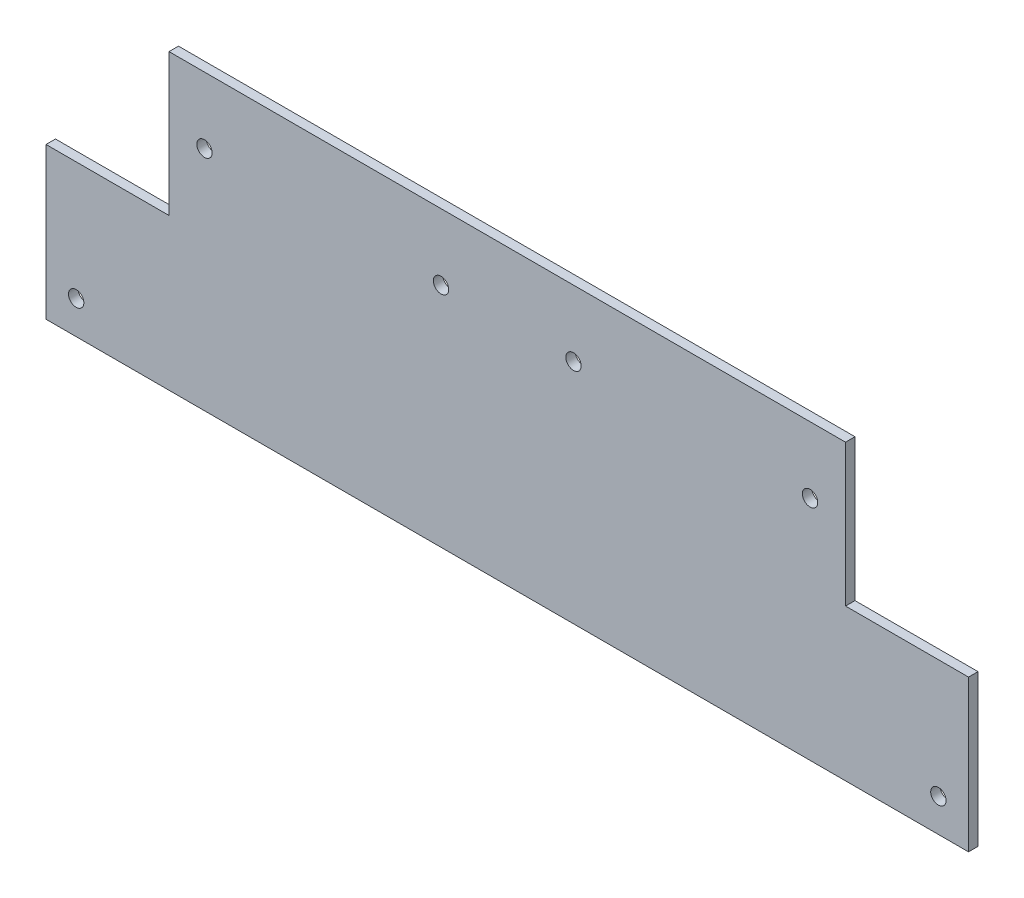
ISO-10303-21;
HEADER;
FILE_DESCRIPTION(('STEP AP214'),'2;1');
FILE_NAME('part.step','',(''),(''),'','','');
FILE_SCHEMA(('AUTOMOTIVE_DESIGN { 1 0 10303 214 1 1 1 1 }'));
ENDSEC;
DATA;
#1=APPLICATION_CONTEXT('core data for automotive mechanical design processes');
#2=APPLICATION_PROTOCOL_DEFINITION('international standard','automotive_design',2000,#1);
#3=PRODUCT_CONTEXT('',#1,'mechanical');
#4=PRODUCT('Part','Part','',(#3));
#5=PRODUCT_RELATED_PRODUCT_CATEGORY('part','',(#4));
#6=PRODUCT_DEFINITION_FORMATION('','',#4);
#7=PRODUCT_DEFINITION_CONTEXT('part definition',#1,'design');
#8=PRODUCT_DEFINITION('design','',#6,#7);
#9=PRODUCT_DEFINITION_SHAPE('','',#8);
#10=(LENGTH_UNIT() NAMED_UNIT(*) SI_UNIT(.MILLI.,.METRE.));
#11=(NAMED_UNIT(*) PLANE_ANGLE_UNIT() SI_UNIT($,.RADIAN.));
#12=(NAMED_UNIT(*) SI_UNIT($,.STERADIAN.) SOLID_ANGLE_UNIT());
#13=UNCERTAINTY_MEASURE_WITH_UNIT(LENGTH_MEASURE(1.E-05),#10,'distance_accuracy_value','');
#14=(GEOMETRIC_REPRESENTATION_CONTEXT(3) GLOBAL_UNCERTAINTY_ASSIGNED_CONTEXT((#13)) GLOBAL_UNIT_ASSIGNED_CONTEXT((#10,
#11,#12)) REPRESENTATION_CONTEXT('',''));
#15=CARTESIAN_POINT('',(0.,0.,0.));
#16=DIRECTION('',(0.,0.,1.));
#17=DIRECTION('',(1.,0.,0.));
#18=AXIS2_PLACEMENT_3D('',#15,#16,#17);
#19=CARTESIAN_POINT('',(0.,0.,2.));
#20=DIRECTION('',(0.,0.,1.));
#21=DIRECTION('',(1.,0.,0.));
#22=AXIS2_PLACEMENT_3D('',#19,#20,#21);
#23=PLANE('',#22);
#24=CARTESIAN_POINT('',(-64.,48.,2.));
#25=DIRECTION('',(0.,0.,1.));
#26=DIRECTION('',(-1.,0.,0.));
#27=AXIS2_PLACEMENT_3D('',#24,#25,#26);
#28=CIRCLE('',#27,1.625);
#29=CARTESIAN_POINT('',(-65.625,48.,2.));
#30=VERTEX_POINT('',#29);
#31=EDGE_CURVE('E203',#30,#30,#28,.T.);
#32=ORIENTED_EDGE('',*,*,#31,.F.);
#33=EDGE_LOOP('',(#32));
#34=FACE_BOUND('',#33,.T.);
#35=CARTESIAN_POINT('',(14.,48.,2.));
#36=DIRECTION('',(0.,0.,1.));
#37=DIRECTION('',(1.,0.,0.));
#38=AXIS2_PLACEMENT_3D('',#35,#36,#37);
#39=CIRCLE('',#38,1.625);
#40=CARTESIAN_POINT('',(15.625,48.,2.));
#41=VERTEX_POINT('',#40);
#42=EDGE_CURVE('E191',#41,#41,#39,.T.);
#43=ORIENTED_EDGE('',*,*,#42,.F.);
#44=EDGE_LOOP('',(#43));
#45=FACE_BOUND('',#44,.T.);
#46=CARTESIAN_POINT('',(91.125,7.,2.));
#47=DIRECTION('',(0.,0.,1.));
#48=DIRECTION('',(1.,0.,0.));
#49=AXIS2_PLACEMENT_3D('',#46,#47,#48);
#50=CIRCLE('',#49,1.625);
#51=CARTESIAN_POINT('',(92.75,7.,2.));
#52=VERTEX_POINT('',#51);
#53=EDGE_CURVE('E137',#52,#52,#50,.T.);
#54=ORIENTED_EDGE('',*,*,#53,.F.);
#55=EDGE_LOOP('',(#54));
#56=FACE_BOUND('',#55,.T.);
#57=DIRECTION('',(0.,1.,0.));
#58=VECTOR('',#57,1.);
#59=CARTESIAN_POINT('',(97.5,0.,2.));
#60=LINE('',#59,#58);
#61=CARTESIAN_POINT('',(97.5,0.,2.));
#62=VERTEX_POINT('',#61);
#63=CARTESIAN_POINT('',(97.5,32.,2.));
#64=VERTEX_POINT('',#63);
#65=EDGE_CURVE('E148',#62,#64,#60,.T.);
#66=ORIENTED_EDGE('',*,*,#65,.T.);
#67=DIRECTION('',(-1.,0.,0.));
#68=VECTOR('',#67,1.);
#69=CARTESIAN_POINT('',(97.5,32.,2.));
#70=LINE('',#69,#68);
#71=CARTESIAN_POINT('',(71.5,32.,2.));
#72=VERTEX_POINT('',#71);
#73=EDGE_CURVE('E96',#64,#72,#70,.T.);
#74=ORIENTED_EDGE('',*,*,#73,.T.);
#75=DIRECTION('',(0.,1.,0.));
#76=VECTOR('',#75,1.);
#77=CARTESIAN_POINT('',(71.5,32.,2.));
#78=LINE('',#77,#76);
#79=CARTESIAN_POINT('',(71.5,62.,2.));
#80=VERTEX_POINT('',#79);
#81=EDGE_CURVE('E163',#72,#80,#78,.T.);
#82=ORIENTED_EDGE('',*,*,#81,.T.);
#83=DIRECTION('',(-1.,0.,0.));
#84=VECTOR('',#83,1.);
#85=CARTESIAN_POINT('',(71.5,62.,2.));
#86=LINE('',#85,#84);
#87=CARTESIAN_POINT('',(-71.5,62.,2.));
#88=VERTEX_POINT('',#87);
#89=EDGE_CURVE('E176',#80,#88,#86,.T.);
#90=ORIENTED_EDGE('',*,*,#89,.T.);
#91=DIRECTION('',(0.,-1.,0.));
#92=VECTOR('',#91,1.);
#93=CARTESIAN_POINT('',(-71.5,32.,2.));
#94=LINE('',#93,#92);
#95=CARTESIAN_POINT('',(-71.5,32.,2.));
#96=VERTEX_POINT('',#95);
#97=EDGE_CURVE('E115',#88,#96,#94,.T.);
#98=ORIENTED_EDGE('',*,*,#97,.T.);
#99=DIRECTION('',(-1.,0.,0.));
#100=VECTOR('',#99,1.);
#101=CARTESIAN_POINT('',(-97.5,32.,2.));
#102=LINE('',#101,#100);
#103=CARTESIAN_POINT('',(-97.5,32.,2.));
#104=VERTEX_POINT('',#103);
#105=EDGE_CURVE('E109',#96,#104,#102,.T.);
#106=ORIENTED_EDGE('',*,*,#105,.T.);
#107=DIRECTION('',(0.,-1.,0.));
#108=VECTOR('',#107,1.);
#109=CARTESIAN_POINT('',(-97.5,0.,2.));
#110=LINE('',#109,#108);
#111=CARTESIAN_POINT('',(-97.5,0.,2.));
#112=VERTEX_POINT('',#111);
#113=EDGE_CURVE('E113',#104,#112,#110,.T.);
#114=ORIENTED_EDGE('',*,*,#113,.T.);
#115=DIRECTION('',(1.,0.,0.));
#116=VECTOR('',#115,1.);
#117=CARTESIAN_POINT('',(-97.5,0.,2.));
#118=LINE('',#117,#116);
#119=EDGE_CURVE('E53',#112,#62,#118,.T.);
#120=ORIENTED_EDGE('',*,*,#119,.T.);
#121=EDGE_LOOP('',(#66,#74,#82,#90,#98,#106,#114,#120));
#122=FACE_BOUND('',#121,.T.);
#123=CARTESIAN_POINT('',(64.,48.,2.));
#124=DIRECTION('',(0.,0.,1.));
#125=DIRECTION('',(1.,0.,0.));
#126=AXIS2_PLACEMENT_3D('',#123,#124,#125);
#127=CIRCLE('',#126,1.625);
#128=CARTESIAN_POINT('',(65.625,48.,2.));
#129=VERTEX_POINT('',#128);
#130=EDGE_CURVE('E185',#129,#129,#127,.T.);
#131=ORIENTED_EDGE('',*,*,#130,.F.);
#132=EDGE_LOOP('',(#131));
#133=FACE_BOUND('',#132,.T.);
#134=CARTESIAN_POINT('',(-14.,48.,2.));
#135=DIRECTION('',(0.,0.,1.));
#136=DIRECTION('',(-1.,0.,0.));
#137=AXIS2_PLACEMENT_3D('',#134,#135,#136);
#138=CIRCLE('',#137,1.625);
#139=CARTESIAN_POINT('',(-15.625,48.,2.));
#140=VERTEX_POINT('',#139);
#141=EDGE_CURVE('E197',#140,#140,#138,.T.);
#142=ORIENTED_EDGE('',*,*,#141,.F.);
#143=EDGE_LOOP('',(#142));
#144=FACE_BOUND('',#143,.T.);
#145=CARTESIAN_POINT('',(-91.125,7.,2.));
#146=DIRECTION('',(0.,0.,1.));
#147=DIRECTION('',(-1.,0.,0.));
#148=AXIS2_PLACEMENT_3D('',#145,#146,#147);
#149=CIRCLE('',#148,1.625);
#150=CARTESIAN_POINT('',(-92.75,7.,2.));
#151=VERTEX_POINT('',#150);
#152=EDGE_CURVE('E209',#151,#151,#149,.T.);
#153=ORIENTED_EDGE('',*,*,#152,.F.);
#154=EDGE_LOOP('',(#153));
#155=FACE_BOUND('',#154,.T.);
#156=ADVANCED_FACE('F36',(#34,#45,#56,#122,#133,#144,#155),#23,.T.);
#157=CARTESIAN_POINT('',(0.,0.,0.));
#158=DIRECTION('',(0.,0.,1.));
#159=DIRECTION('',(1.,0.,0.));
#160=AXIS2_PLACEMENT_3D('',#157,#158,#159);
#161=PLANE('',#160);
#162=DIRECTION('',(0.,1.,0.));
#163=VECTOR('',#162,1.);
#164=CARTESIAN_POINT('',(97.5,0.,0.));
#165=LINE('',#164,#163);
#166=CARTESIAN_POINT('',(97.5,0.,0.));
#167=VERTEX_POINT('',#166);
#168=CARTESIAN_POINT('',(97.5,32.,0.));
#169=VERTEX_POINT('',#168);
#170=EDGE_CURVE('E133',#167,#169,#165,.T.);
#171=ORIENTED_EDGE('',*,*,#170,.F.);
#172=DIRECTION('',(1.,0.,0.));
#173=VECTOR('',#172,1.);
#174=CARTESIAN_POINT('',(-97.5,0.,0.));
#175=LINE('',#174,#173);
#176=CARTESIAN_POINT('',(-97.5,0.,0.));
#177=VERTEX_POINT('',#176);
#178=EDGE_CURVE('E88',#177,#167,#175,.T.);
#179=ORIENTED_EDGE('',*,*,#178,.F.);
#180=DIRECTION('',(0.,-1.,0.));
#181=VECTOR('',#180,1.);
#182=CARTESIAN_POINT('',(-97.5,0.,0.));
#183=LINE('',#182,#181);
#184=CARTESIAN_POINT('',(-97.5,32.,0.));
#185=VERTEX_POINT('',#184);
#186=EDGE_CURVE('E82',#185,#177,#183,.T.);
#187=ORIENTED_EDGE('',*,*,#186,.F.);
#188=DIRECTION('',(-1.,0.,0.));
#189=VECTOR('',#188,1.);
#190=CARTESIAN_POINT('',(-97.5,32.,0.));
#191=LINE('',#190,#189);
#192=CARTESIAN_POINT('',(-71.5,32.,0.));
#193=VERTEX_POINT('',#192);
#194=EDGE_CURVE('E123',#193,#185,#191,.T.);
#195=ORIENTED_EDGE('',*,*,#194,.F.);
#196=DIRECTION('',(0.,-1.,0.));
#197=VECTOR('',#196,1.);
#198=CARTESIAN_POINT('',(-71.5,32.,0.));
#199=LINE('',#198,#197);
#200=CARTESIAN_POINT('',(-71.5,62.,0.));
#201=VERTEX_POINT('',#200);
#202=EDGE_CURVE('E143',#201,#193,#199,.T.);
#203=ORIENTED_EDGE('',*,*,#202,.F.);
#204=DIRECTION('',(-1.,0.,0.));
#205=VECTOR('',#204,1.);
#206=CARTESIAN_POINT('',(71.5,62.,0.));
#207=LINE('',#206,#205);
#208=CARTESIAN_POINT('',(71.5,62.,0.));
#209=VERTEX_POINT('',#208);
#210=EDGE_CURVE('E141',#209,#201,#207,.T.);
#211=ORIENTED_EDGE('',*,*,#210,.F.);
#212=DIRECTION('',(0.,1.,0.));
#213=VECTOR('',#212,1.);
#214=CARTESIAN_POINT('',(71.5,32.,0.));
#215=LINE('',#214,#213);
#216=CARTESIAN_POINT('',(71.5,32.,0.));
#217=VERTEX_POINT('',#216);
#218=EDGE_CURVE('E139',#217,#209,#215,.T.);
#219=ORIENTED_EDGE('',*,*,#218,.F.);
#220=DIRECTION('',(-1.,0.,0.));
#221=VECTOR('',#220,1.);
#222=CARTESIAN_POINT('',(97.5,32.,0.));
#223=LINE('',#222,#221);
#224=EDGE_CURVE('E136',#169,#217,#223,.T.);
#225=ORIENTED_EDGE('',*,*,#224,.F.);
#226=EDGE_LOOP('',(#171,#179,#187,#195,#203,#211,#219,#225));
#227=FACE_BOUND('',#226,.T.);
#228=CARTESIAN_POINT('',(91.125,7.,0.));
#229=DIRECTION('',(0.,0.,1.));
#230=DIRECTION('',(1.,0.,0.));
#231=AXIS2_PLACEMENT_3D('',#228,#229,#230);
#232=CIRCLE('',#231,1.625);
#233=CARTESIAN_POINT('',(92.75,7.,0.));
#234=VERTEX_POINT('',#233);
#235=EDGE_CURVE('E182',#234,#234,#232,.T.);
#236=ORIENTED_EDGE('',*,*,#235,.T.);
#237=EDGE_LOOP('',(#236));
#238=FACE_BOUND('',#237,.T.);
#239=CARTESIAN_POINT('',(64.,48.,0.));
#240=DIRECTION('',(0.,0.,1.));
#241=DIRECTION('',(1.,0.,0.));
#242=AXIS2_PLACEMENT_3D('',#239,#240,#241);
#243=CIRCLE('',#242,1.625);
#244=CARTESIAN_POINT('',(65.625,48.,0.));
#245=VERTEX_POINT('',#244);
#246=EDGE_CURVE('E188',#245,#245,#243,.T.);
#247=ORIENTED_EDGE('',*,*,#246,.T.);
#248=EDGE_LOOP('',(#247));
#249=FACE_BOUND('',#248,.T.);
#250=CARTESIAN_POINT('',(14.,48.,0.));
#251=DIRECTION('',(0.,0.,1.));
#252=DIRECTION('',(1.,0.,0.));
#253=AXIS2_PLACEMENT_3D('',#250,#251,#252);
#254=CIRCLE('',#253,1.625);
#255=CARTESIAN_POINT('',(15.625,48.,0.));
#256=VERTEX_POINT('',#255);
#257=EDGE_CURVE('E194',#256,#256,#254,.T.);
#258=ORIENTED_EDGE('',*,*,#257,.T.);
#259=EDGE_LOOP('',(#258));
#260=FACE_BOUND('',#259,.T.);
#261=CARTESIAN_POINT('',(-14.,48.,0.));
#262=DIRECTION('',(0.,0.,1.));
#263=DIRECTION('',(-1.,0.,0.));
#264=AXIS2_PLACEMENT_3D('',#261,#262,#263);
#265=CIRCLE('',#264,1.625);
#266=CARTESIAN_POINT('',(-15.625,48.,0.));
#267=VERTEX_POINT('',#266);
#268=EDGE_CURVE('E200',#267,#267,#265,.T.);
#269=ORIENTED_EDGE('',*,*,#268,.T.);
#270=EDGE_LOOP('',(#269));
#271=FACE_BOUND('',#270,.T.);
#272=CARTESIAN_POINT('',(-64.,48.,0.));
#273=DIRECTION('',(0.,0.,1.));
#274=DIRECTION('',(-1.,0.,0.));
#275=AXIS2_PLACEMENT_3D('',#272,#273,#274);
#276=CIRCLE('',#275,1.625);
#277=CARTESIAN_POINT('',(-65.625,48.,0.));
#278=VERTEX_POINT('',#277);
#279=EDGE_CURVE('E206',#278,#278,#276,.T.);
#280=ORIENTED_EDGE('',*,*,#279,.T.);
#281=EDGE_LOOP('',(#280));
#282=FACE_BOUND('',#281,.T.);
#283=CARTESIAN_POINT('',(-91.125,7.,0.));
#284=DIRECTION('',(0.,0.,1.));
#285=DIRECTION('',(-1.,0.,0.));
#286=AXIS2_PLACEMENT_3D('',#283,#284,#285);
#287=CIRCLE('',#286,1.625);
#288=CARTESIAN_POINT('',(-92.75,7.,0.));
#289=VERTEX_POINT('',#288);
#290=EDGE_CURVE('E212',#289,#289,#287,.T.);
#291=ORIENTED_EDGE('',*,*,#290,.T.);
#292=EDGE_LOOP('',(#291));
#293=FACE_BOUND('',#292,.T.);
#294=ADVANCED_FACE('F167',(#227,#238,#249,#260,#271,#282,#293),#161,.F.);
#295=CARTESIAN_POINT('',(97.5,0.,2.));
#296=DIRECTION('',(-1.,0.,0.));
#297=DIRECTION('',(0.,0.,1.));
#298=AXIS2_PLACEMENT_3D('',#295,#296,#297);
#299=PLANE('',#298);
#300=ORIENTED_EDGE('',*,*,#170,.T.);
#301=DIRECTION('',(0.,0.,-1.));
#302=VECTOR('',#301,1.);
#303=CARTESIAN_POINT('',(97.5,32.,2.));
#304=LINE('',#303,#302);
#305=EDGE_CURVE('E11',#64,#169,#304,.T.);
#306=ORIENTED_EDGE('',*,*,#305,.F.);
#307=ORIENTED_EDGE('',*,*,#65,.F.);
#308=DIRECTION('',(0.,0.,-1.));
#309=VECTOR('',#308,1.);
#310=CARTESIAN_POINT('',(97.5,0.,2.));
#311=LINE('',#310,#309);
#312=EDGE_CURVE('E129',#62,#167,#311,.T.);
#313=ORIENTED_EDGE('',*,*,#312,.T.);
#314=EDGE_LOOP('',(#300,#306,#307,#313));
#315=FACE_BOUND('',#314,.T.);
#316=ADVANCED_FACE('F38',(#315),#299,.F.);
#317=CARTESIAN_POINT('',(97.5,32.,2.));
#318=DIRECTION('',(0.,-1.,0.));
#319=DIRECTION('',(0.,0.,-1.));
#320=AXIS2_PLACEMENT_3D('',#317,#318,#319);
#321=PLANE('',#320);
#322=ORIENTED_EDGE('',*,*,#224,.T.);
#323=DIRECTION('',(0.,0.,-1.));
#324=VECTOR('',#323,1.);
#325=CARTESIAN_POINT('',(71.5,32.,2.));
#326=LINE('',#325,#324);
#327=EDGE_CURVE('E45',#72,#217,#326,.T.);
#328=ORIENTED_EDGE('',*,*,#327,.F.);
#329=ORIENTED_EDGE('',*,*,#73,.F.);
#330=ORIENTED_EDGE('',*,*,#305,.T.);
#331=EDGE_LOOP('',(#322,#328,#329,#330));
#332=FACE_BOUND('',#331,.T.);
#333=ADVANCED_FACE('F246',(#332),#321,.F.);
#334=CARTESIAN_POINT('',(71.5,32.,2.));
#335=DIRECTION('',(-1.,0.,0.));
#336=DIRECTION('',(0.,0.,1.));
#337=AXIS2_PLACEMENT_3D('',#334,#335,#336);
#338=PLANE('',#337);
#339=ORIENTED_EDGE('',*,*,#218,.T.);
#340=DIRECTION('',(0.,0.,-1.));
#341=VECTOR('',#340,1.);
#342=CARTESIAN_POINT('',(71.5,62.,2.));
#343=LINE('',#342,#341);
#344=EDGE_CURVE('E155',#80,#209,#343,.T.);
#345=ORIENTED_EDGE('',*,*,#344,.F.);
#346=ORIENTED_EDGE('',*,*,#81,.F.);
#347=ORIENTED_EDGE('',*,*,#327,.T.);
#348=EDGE_LOOP('',(#339,#345,#346,#347));
#349=FACE_BOUND('',#348,.T.);
#350=ADVANCED_FACE('F161',(#349),#338,.F.);
#351=CARTESIAN_POINT('',(71.5,62.,2.));
#352=DIRECTION('',(0.,-1.,0.));
#353=DIRECTION('',(0.,0.,-1.));
#354=AXIS2_PLACEMENT_3D('',#351,#352,#353);
#355=PLANE('',#354);
#356=ORIENTED_EDGE('',*,*,#210,.T.);
#357=DIRECTION('',(0.,0.,-1.));
#358=VECTOR('',#357,1.);
#359=CARTESIAN_POINT('',(-71.5,62.,2.));
#360=LINE('',#359,#358);
#361=EDGE_CURVE('E152',#88,#201,#360,.T.);
#362=ORIENTED_EDGE('',*,*,#361,.F.);
#363=ORIENTED_EDGE('',*,*,#89,.F.);
#364=ORIENTED_EDGE('',*,*,#344,.T.);
#365=EDGE_LOOP('',(#356,#362,#363,#364));
#366=FACE_BOUND('',#365,.T.);
#367=ADVANCED_FACE('F172',(#366),#355,.F.);
#368=CARTESIAN_POINT('',(-71.5,32.,2.));
#369=DIRECTION('',(1.,0.,0.));
#370=DIRECTION('',(0.,0.,-1.));
#371=AXIS2_PLACEMENT_3D('',#368,#369,#370);
#372=PLANE('',#371);
#373=ORIENTED_EDGE('',*,*,#202,.T.);
#374=DIRECTION('',(0.,0.,-1.));
#375=VECTOR('',#374,1.);
#376=CARTESIAN_POINT('',(-71.5,32.,2.));
#377=LINE('',#376,#375);
#378=EDGE_CURVE('E124',#96,#193,#377,.T.);
#379=ORIENTED_EDGE('',*,*,#378,.F.);
#380=ORIENTED_EDGE('',*,*,#97,.F.);
#381=ORIENTED_EDGE('',*,*,#361,.T.);
#382=EDGE_LOOP('',(#373,#379,#380,#381));
#383=FACE_BOUND('',#382,.T.);
#384=ADVANCED_FACE('F175',(#383),#372,.F.);
#385=CARTESIAN_POINT('',(-97.5,32.,2.));
#386=DIRECTION('',(0.,-1.,0.));
#387=DIRECTION('',(0.,0.,-1.));
#388=AXIS2_PLACEMENT_3D('',#385,#386,#387);
#389=PLANE('',#388);
#390=ORIENTED_EDGE('',*,*,#194,.T.);
#391=DIRECTION('',(0.,0.,-1.));
#392=VECTOR('',#391,1.);
#393=CARTESIAN_POINT('',(-97.5,32.,2.));
#394=LINE('',#393,#392);
#395=EDGE_CURVE('E120',#104,#185,#394,.T.);
#396=ORIENTED_EDGE('',*,*,#395,.F.);
#397=ORIENTED_EDGE('',*,*,#105,.F.);
#398=ORIENTED_EDGE('',*,*,#378,.T.);
#399=EDGE_LOOP('',(#390,#396,#397,#398));
#400=FACE_BOUND('',#399,.T.);
#401=ADVANCED_FACE('F121',(#400),#389,.F.);
#402=CARTESIAN_POINT('',(-97.5,0.,2.));
#403=DIRECTION('',(1.,0.,0.));
#404=DIRECTION('',(0.,0.,-1.));
#405=AXIS2_PLACEMENT_3D('',#402,#403,#404);
#406=PLANE('',#405);
#407=ORIENTED_EDGE('',*,*,#186,.T.);
#408=DIRECTION('',(0.,0.,-1.));
#409=VECTOR('',#408,1.);
#410=CARTESIAN_POINT('',(-97.5,0.,2.));
#411=LINE('',#410,#409);
#412=EDGE_CURVE('E125',#112,#177,#411,.T.);
#413=ORIENTED_EDGE('',*,*,#412,.F.);
#414=ORIENTED_EDGE('',*,*,#113,.F.);
#415=ORIENTED_EDGE('',*,*,#395,.T.);
#416=EDGE_LOOP('',(#407,#413,#414,#415));
#417=FACE_BOUND('',#416,.T.);
#418=ADVANCED_FACE('F127',(#417),#406,.F.);
#419=CARTESIAN_POINT('',(-97.5,0.,2.));
#420=DIRECTION('',(0.,1.,0.));
#421=DIRECTION('',(0.,0.,1.));
#422=AXIS2_PLACEMENT_3D('',#419,#420,#421);
#423=PLANE('',#422);
#424=ORIENTED_EDGE('',*,*,#178,.T.);
#425=ORIENTED_EDGE('',*,*,#312,.F.);
#426=ORIENTED_EDGE('',*,*,#119,.F.);
#427=ORIENTED_EDGE('',*,*,#412,.T.);
#428=EDGE_LOOP('',(#424,#425,#426,#427));
#429=FACE_BOUND('',#428,.T.);
#430=ADVANCED_FACE('F234',(#429),#423,.F.);
#431=CARTESIAN_POINT('',(91.125,7.,2.));
#432=DIRECTION('',(0.,0.,-1.));
#433=DIRECTION('',(-1.,0.,0.));
#434=AXIS2_PLACEMENT_3D('',#431,#432,#433);
#435=CYLINDRICAL_SURFACE('',#434,1.625);
#436=ORIENTED_EDGE('',*,*,#53,.T.);
#437=EDGE_LOOP('',(#436));
#438=FACE_BOUND('',#437,.T.);
#439=ORIENTED_EDGE('',*,*,#235,.F.);
#440=EDGE_LOOP('',(#439));
#441=FACE_BOUND('',#440,.T.);
#442=ADVANCED_FACE('F231',(#438,#441),#435,.F.);
#443=CARTESIAN_POINT('',(64.,48.,2.));
#444=DIRECTION('',(0.,0.,-1.));
#445=DIRECTION('',(-1.,0.,0.));
#446=AXIS2_PLACEMENT_3D('',#443,#444,#445);
#447=CYLINDRICAL_SURFACE('',#446,1.625);
#448=ORIENTED_EDGE('',*,*,#130,.T.);
#449=EDGE_LOOP('',(#448));
#450=FACE_BOUND('',#449,.T.);
#451=ORIENTED_EDGE('',*,*,#246,.F.);
#452=EDGE_LOOP('',(#451));
#453=FACE_BOUND('',#452,.T.);
#454=ADVANCED_FACE('F310',(#450,#453),#447,.F.);
#455=CARTESIAN_POINT('',(14.,48.,2.));
#456=DIRECTION('',(0.,0.,-1.));
#457=DIRECTION('',(-1.,0.,0.));
#458=AXIS2_PLACEMENT_3D('',#455,#456,#457);
#459=CYLINDRICAL_SURFACE('',#458,1.625);
#460=ORIENTED_EDGE('',*,*,#42,.T.);
#461=EDGE_LOOP('',(#460));
#462=FACE_BOUND('',#461,.T.);
#463=ORIENTED_EDGE('',*,*,#257,.F.);
#464=EDGE_LOOP('',(#463));
#465=FACE_BOUND('',#464,.T.);
#466=ADVANCED_FACE('F318',(#462,#465),#459,.F.);
#467=CARTESIAN_POINT('',(-14.,48.,2.));
#468=DIRECTION('',(0.,0.,-1.));
#469=DIRECTION('',(-1.,0.,0.));
#470=AXIS2_PLACEMENT_3D('',#467,#468,#469);
#471=CYLINDRICAL_SURFACE('',#470,1.625);
#472=ORIENTED_EDGE('',*,*,#141,.T.);
#473=EDGE_LOOP('',(#472));
#474=FACE_BOUND('',#473,.T.);
#475=ORIENTED_EDGE('',*,*,#268,.F.);
#476=EDGE_LOOP('',(#475));
#477=FACE_BOUND('',#476,.T.);
#478=ADVANCED_FACE('F326',(#474,#477),#471,.F.);
#479=CARTESIAN_POINT('',(-64.,48.,2.));
#480=DIRECTION('',(0.,0.,-1.));
#481=DIRECTION('',(-1.,0.,0.));
#482=AXIS2_PLACEMENT_3D('',#479,#480,#481);
#483=CYLINDRICAL_SURFACE('',#482,1.625);
#484=ORIENTED_EDGE('',*,*,#31,.T.);
#485=EDGE_LOOP('',(#484));
#486=FACE_BOUND('',#485,.T.);
#487=ORIENTED_EDGE('',*,*,#279,.F.);
#488=EDGE_LOOP('',(#487));
#489=FACE_BOUND('',#488,.T.);
#490=ADVANCED_FACE('F335',(#486,#489),#483,.F.);
#491=CARTESIAN_POINT('',(-91.125,7.,2.));
#492=DIRECTION('',(0.,0.,-1.));
#493=DIRECTION('',(-1.,0.,0.));
#494=AXIS2_PLACEMENT_3D('',#491,#492,#493);
#495=CYLINDRICAL_SURFACE('',#494,1.625);
#496=ORIENTED_EDGE('',*,*,#152,.T.);
#497=EDGE_LOOP('',(#496));
#498=FACE_BOUND('',#497,.T.);
#499=ORIENTED_EDGE('',*,*,#290,.F.);
#500=EDGE_LOOP('',(#499));
#501=FACE_BOUND('',#500,.T.);
#502=ADVANCED_FACE('F218',(#498,#501),#495,.F.);
#503=CLOSED_SHELL('',(#156,#294,#316,#333,#350,#367,#384,#401,#418,#430,#442,#454,#466,#478,
#490,#502));
#504=MANIFOLD_SOLID_BREP('B2',#503);
#505=ADVANCED_BREP_SHAPE_REPRESENTATION('',(#18,#504),#14);
#506=SHAPE_DEFINITION_REPRESENTATION(#9,#505);
ENDSEC;
END-ISO-10303-21;
